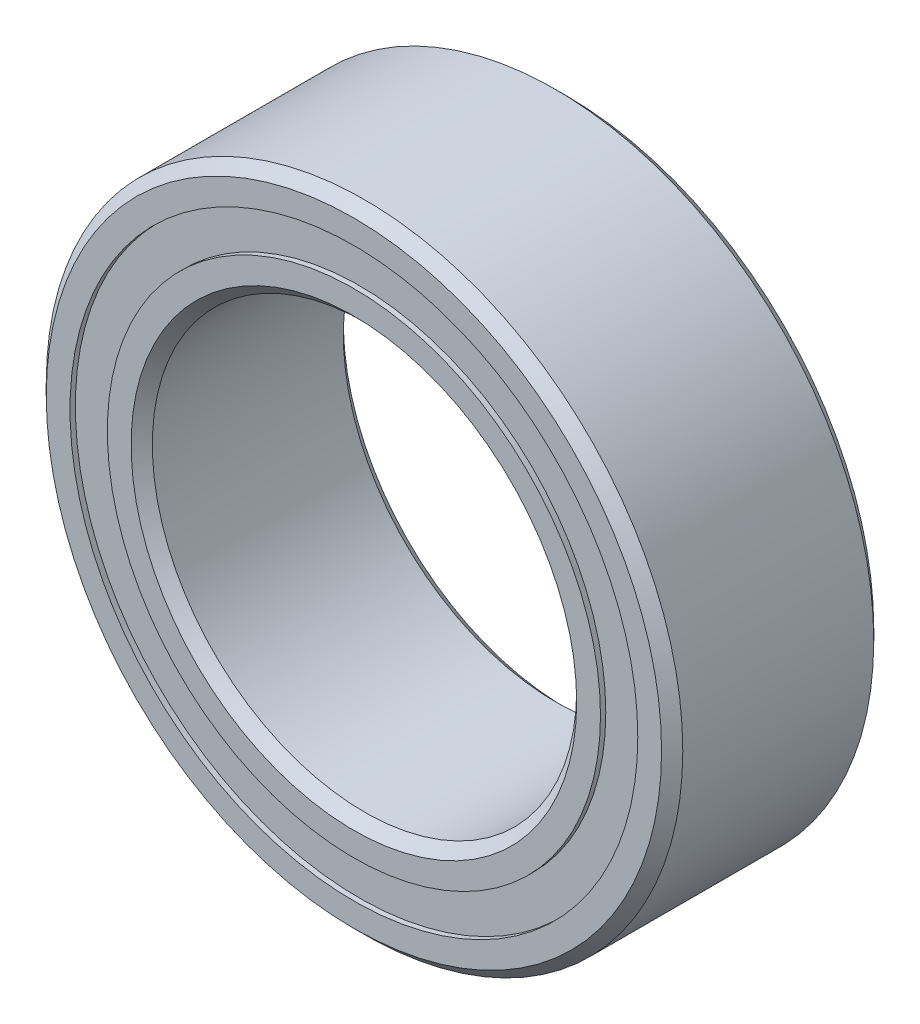
ISO-10303-21;
HEADER;
FILE_DESCRIPTION(('STEP AP214'),'2;1');
FILE_NAME('part.step','',(''),(''),'','','');
FILE_SCHEMA(('AUTOMOTIVE_DESIGN { 1 0 10303 214 1 1 1 1 }'));
ENDSEC;
DATA;
#1=APPLICATION_CONTEXT('core data for automotive mechanical design processes');
#2=APPLICATION_PROTOCOL_DEFINITION('international standard','automotive_design',2000,#1);
#3=PRODUCT_CONTEXT('',#1,'mechanical');
#4=PRODUCT('Part','Part','',(#3));
#5=PRODUCT_RELATED_PRODUCT_CATEGORY('part','',(#4));
#6=PRODUCT_DEFINITION_FORMATION('','',#4);
#7=PRODUCT_DEFINITION_CONTEXT('part definition',#1,'design');
#8=PRODUCT_DEFINITION('design','',#6,#7);
#9=PRODUCT_DEFINITION_SHAPE('','',#8);
#10=(LENGTH_UNIT() NAMED_UNIT(*) SI_UNIT(.MILLI.,.METRE.));
#11=(NAMED_UNIT(*) PLANE_ANGLE_UNIT() SI_UNIT($,.RADIAN.));
#12=(NAMED_UNIT(*) SI_UNIT($,.STERADIAN.) SOLID_ANGLE_UNIT());
#13=UNCERTAINTY_MEASURE_WITH_UNIT(LENGTH_MEASURE(1.E-05),#10,'distance_accuracy_value','');
#14=(GEOMETRIC_REPRESENTATION_CONTEXT(3) GLOBAL_UNCERTAINTY_ASSIGNED_CONTEXT((#13)) GLOBAL_UNIT_ASSIGNED_CONTEXT((#10,
#11,#12)) REPRESENTATION_CONTEXT('',''));
#15=CARTESIAN_POINT('',(0.,0.,0.));
#16=DIRECTION('',(0.,0.,1.));
#17=DIRECTION('',(1.,0.,0.));
#18=AXIS2_PLACEMENT_3D('',#15,#16,#17);
#19=CARTESIAN_POINT('',(-3.43703832126951,-1.98437499999997,0.));
#20=DIRECTION('',(-0.866025403784443,-0.499999999999992,0.));
#21=DIRECTION('',(0.,0.,-1.));
#22=AXIS2_PLACEMENT_3D('',#19,#20,#21);
#23=SPHERICAL_SURFACE('',#22,0.758760243513404);
#24=CARTESIAN_POINT('',(-4.09414396753379,-2.36375512175666,0.));
#25=VERTEX_POINT('',#24);
#26=VERTEX_LOOP('',#25);
#27=FACE_BOUND('',#26,.T.);
#28=CARTESIAN_POINT('',(-2.77993267500523,-1.60499487824327,0.));
#29=VERTEX_POINT('',#28);
#30=VERTEX_LOOP('',#29);
#31=FACE_BOUND('',#30,.T.);
#32=ADVANCED_FACE('P0_F15',(#27,#31),#23,.T.);
#33=CLOSED_SHELL('',(#32));
#34=MANIFOLD_SOLID_BREP('P0_B1',#33);
#35=CARTESIAN_POINT('',(-3.96875,0.,0.));
#36=DIRECTION('',(-1.,0.,0.));
#37=DIRECTION('',(0.,0.,-1.));
#38=AXIS2_PLACEMENT_3D('',#35,#36,#37);
#39=SPHERICAL_SURFACE('',#38,0.758760243513404);
#40=CARTESIAN_POINT('',(-4.7275102435134,0.,0.));
#41=VERTEX_POINT('',#40);
#42=VERTEX_LOOP('',#41);
#43=FACE_BOUND('',#42,.T.);
#44=CARTESIAN_POINT('',(-3.2099897564866,0.,0.));
#45=VERTEX_POINT('',#44);
#46=VERTEX_LOOP('',#45);
#47=FACE_BOUND('',#46,.T.);
#48=ADVANCED_FACE('P1_F15',(#43,#47),#39,.T.);
#49=CLOSED_SHELL('',(#48));
#50=MANIFOLD_SOLID_BREP('P1_B1',#49);
#51=CARTESIAN_POINT('',(0.,3.96875,0.));
#52=DIRECTION('',(0.,1.,0.));
#53=DIRECTION('',(0.,0.,-1.));
#54=AXIS2_PLACEMENT_3D('',#51,#52,#53);
#55=SPHERICAL_SURFACE('',#54,0.758760243513404);
#56=CARTESIAN_POINT('',(0.,3.2099897564866,0.));
#57=VERTEX_POINT('',#56);
#58=VERTEX_LOOP('',#57);
#59=FACE_BOUND('',#58,.T.);
#60=CARTESIAN_POINT('',(0.,4.7275102435134,0.));
#61=VERTEX_POINT('',#60);
#62=VERTEX_LOOP('',#61);
#63=FACE_BOUND('',#62,.T.);
#64=ADVANCED_FACE('P2_F15',(#59,#63),#55,.T.);
#65=CLOSED_SHELL('',(#64));
#66=MANIFOLD_SOLID_BREP('P2_B1',#65);
#67=CARTESIAN_POINT('',(3.43703832126948,-1.98437500000002,0.));
#68=DIRECTION('',(0.866025403784437,-0.500000000000004,0.));
#69=DIRECTION('',(0.,0.,-1.));
#70=AXIS2_PLACEMENT_3D('',#67,#68,#69);
#71=SPHERICAL_SURFACE('',#70,0.758760243513404);
#72=CARTESIAN_POINT('',(4.09414396753376,-2.36375512175672,0.));
#73=VERTEX_POINT('',#72);
#74=VERTEX_LOOP('',#73);
#75=FACE_BOUND('',#74,.T.);
#76=CARTESIAN_POINT('',(2.77993267500521,-1.60499487824331,0.));
#77=VERTEX_POINT('',#76);
#78=VERTEX_LOOP('',#77);
#79=FACE_BOUND('',#78,.T.);
#80=ADVANCED_FACE('P3_F15',(#75,#79),#71,.T.);
#81=CLOSED_SHELL('',(#80));
#82=MANIFOLD_SOLID_BREP('P3_B1',#81);
#83=CARTESIAN_POINT('',(-1.98437500000003,-3.43703832126947,0.));
#84=DIRECTION('',(-0.500000000000007,-0.866025403784435,0.));
#85=DIRECTION('',(0.,0.,-1.));
#86=AXIS2_PLACEMENT_3D('',#83,#84,#85);
#87=SPHERICAL_SURFACE('',#86,0.758760243513404);
#88=CARTESIAN_POINT('',(-2.36375512175674,-4.09414396753375,0.));
#89=VERTEX_POINT('',#88);
#90=VERTEX_LOOP('',#89);
#91=FACE_BOUND('',#90,.T.);
#92=CARTESIAN_POINT('',(-1.60499487824332,-2.7799326750052,0.));
#93=VERTEX_POINT('',#92);
#94=VERTEX_LOOP('',#93);
#95=FACE_BOUND('',#94,.T.);
#96=ADVANCED_FACE('P4_F15',(#91,#95),#87,.T.);
#97=CLOSED_SHELL('',(#96));
#98=MANIFOLD_SOLID_BREP('P4_B1',#97);
#99=CARTESIAN_POINT('',(3.96875,0.,0.));
#100=DIRECTION('',(1.,0.,0.));
#101=DIRECTION('',(0.,0.,-1.));
#102=AXIS2_PLACEMENT_3D('',#99,#100,#101);
#103=SPHERICAL_SURFACE('',#102,0.758760243513404);
#104=CARTESIAN_POINT('',(3.2099897564866,0.,0.));
#105=VERTEX_POINT('',#104);
#106=VERTEX_LOOP('',#105);
#107=FACE_BOUND('',#106,.T.);
#108=CARTESIAN_POINT('',(4.7275102435134,0.,0.));
#109=VERTEX_POINT('',#108);
#110=VERTEX_LOOP('',#109);
#111=FACE_BOUND('',#110,.T.);
#112=ADVANCED_FACE('P5_F15',(#107,#111),#103,.T.);
#113=CLOSED_SHELL('',(#112));
#114=MANIFOLD_SOLID_BREP('P5_B1',#113);
#115=CARTESIAN_POINT('',(0.,4.24787087912088,0.758760243513404));
#116=DIRECTION('',(0.,0.,1.));
#117=DIRECTION('',(1.,0.,0.));
#118=AXIS2_PLACEMENT_3D('',#115,#116,#117);
#119=PLANE('',#118);
#120=CARTESIAN_POINT('',(0.,0.,0.758760243513404));
#121=DIRECTION('',(0.,0.,1.));
#122=DIRECTION('',(1.,0.,0.));
#123=AXIS2_PLACEMENT_3D('',#120,#121,#122);
#124=CIRCLE('',#123,3.68962912087912);
#125=CARTESIAN_POINT('',(3.68962912087912,0.,0.758760243513404));
#126=VERTEX_POINT('',#125);
#127=EDGE_CURVE('P6_E17',#126,#126,#124,.T.);
#128=ORIENTED_EDGE('',*,*,#127,.T.);
#129=EDGE_LOOP('',(#128));
#130=FACE_BOUND('',#129,.T.);
#131=CARTESIAN_POINT('',(0.,0.,0.758760243513404));
#132=DIRECTION('',(0.,0.,1.));
#133=DIRECTION('',(1.,0.,0.));
#134=AXIS2_PLACEMENT_3D('',#131,#132,#133);
#135=CIRCLE('',#134,4.24787087912088);
#136=CARTESIAN_POINT('',(4.24787087912088,0.,0.758760243513404));
#137=VERTEX_POINT('',#136);
#138=EDGE_CURVE('P6_E26',#137,#137,#135,.T.);
#139=ORIENTED_EDGE('',*,*,#138,.F.);
#140=EDGE_LOOP('',(#139));
#141=FACE_BOUND('',#140,.T.);
#142=ADVANCED_FACE('P6_F14',(#130,#141),#119,.F.);
#143=CARTESIAN_POINT('',(0.,0.,1.5875));
#144=DIRECTION('',(0.,0.,1.));
#145=DIRECTION('',(1.,0.,0.));
#146=AXIS2_PLACEMENT_3D('',#143,#144,#145);
#147=CYLINDRICAL_SURFACE('',#146,3.68962912087912);
#148=ORIENTED_EDGE('',*,*,#127,.F.);
#149=EDGE_LOOP('',(#148));
#150=FACE_BOUND('',#149,.T.);
#151=CARTESIAN_POINT('',(0.,0.,1.508125));
#152=DIRECTION('',(0.,0.,1.));
#153=DIRECTION('',(1.,0.,0.));
#154=AXIS2_PLACEMENT_3D('',#151,#152,#153);
#155=CIRCLE('',#154,3.68962912087912);
#156=CARTESIAN_POINT('',(3.68962912087912,0.,1.508125));
#157=VERTEX_POINT('',#156);
#158=EDGE_CURVE('P6_E21',#157,#157,#155,.T.);
#159=ORIENTED_EDGE('',*,*,#158,.T.);
#160=EDGE_LOOP('',(#159));
#161=FACE_BOUND('',#160,.T.);
#162=ADVANCED_FACE('P6_F36',(#150,#161),#147,.F.);
#163=CARTESIAN_POINT('',(0.,0.,1.5875));
#164=DIRECTION('',(0.,0.,1.));
#165=DIRECTION('',(1.,0.,0.));
#166=AXIS2_PLACEMENT_3D('',#163,#164,#165);
#167=CYLINDRICAL_SURFACE('',#166,4.24787087912088);
#168=CARTESIAN_POINT('',(0.,0.,1.508125));
#169=DIRECTION('',(0.,0.,1.));
#170=DIRECTION('',(1.,0.,0.));
#171=AXIS2_PLACEMENT_3D('',#168,#169,#170);
#172=CIRCLE('',#171,4.24787087912088);
#173=CARTESIAN_POINT('',(4.24787087912088,0.,1.508125));
#174=VERTEX_POINT('',#173);
#175=EDGE_CURVE('P6_E10',#174,#174,#172,.F.);
#176=ORIENTED_EDGE('',*,*,#175,.T.);
#177=EDGE_LOOP('',(#176));
#178=FACE_BOUND('',#177,.T.);
#179=ORIENTED_EDGE('',*,*,#138,.T.);
#180=EDGE_LOOP('',(#179));
#181=FACE_BOUND('',#180,.T.);
#182=ADVANCED_FACE('P6_F39',(#178,#181),#167,.T.);
#183=CARTESIAN_POINT('',(0.,4.24787087912088,1.508125));
#184=DIRECTION('',(0.,0.,-1.));
#185=DIRECTION('',(-1.,0.,0.));
#186=AXIS2_PLACEMENT_3D('',#183,#184,#185);
#187=PLANE('',#186);
#188=ORIENTED_EDGE('',*,*,#175,.F.);
#189=EDGE_LOOP('',(#188));
#190=FACE_BOUND('',#189,.T.);
#191=ORIENTED_EDGE('',*,*,#158,.F.);
#192=EDGE_LOOP('',(#191));
#193=FACE_BOUND('',#192,.T.);
#194=ADVANCED_FACE('P6_F42',(#190,#193),#187,.F.);
#195=CLOSED_SHELL('',(#142,#162,#182,#194));
#196=MANIFOLD_SOLID_BREP('P6_B1',#195);
#197=CARTESIAN_POINT('',(1.984375,3.43703832126949,0.));
#198=DIRECTION('',(0.500000000000001,0.866025403784438,0.));
#199=DIRECTION('',(0.,0.,-1.));
#200=AXIS2_PLACEMENT_3D('',#197,#198,#199);
#201=SPHERICAL_SURFACE('',#200,0.758760243513404);
#202=CARTESIAN_POINT('',(2.36375512175671,4.09414396753376,0.));
#203=VERTEX_POINT('',#202);
#204=VERTEX_LOOP('',#203);
#205=FACE_BOUND('',#204,.T.);
#206=CARTESIAN_POINT('',(1.6049948782433,2.77993267500521,0.));
#207=VERTEX_POINT('',#206);
#208=VERTEX_LOOP('',#207);
#209=FACE_BOUND('',#208,.T.);
#210=ADVANCED_FACE('P7_F15',(#205,#209),#201,.T.);
#211=CLOSED_SHELL('',(#210));
#212=MANIFOLD_SOLID_BREP('P7_B1',#211);
#213=CARTESIAN_POINT('',(0.,0.,0.));
#214=DIRECTION('',(0.,0.,1.));
#215=DIRECTION('',(1.,0.,0.));
#216=AXIS2_PLACEMENT_3D('',#213,#214,#215);
#217=TOROIDAL_SURFACE('',#216,3.96875,0.758760243513404);
#218=CARTESIAN_POINT('',(0.,0.,-0.705555555555556));
#219=DIRECTION('',(0.,0.,1.));
#220=DIRECTION('',(1.,0.,0.));
#221=AXIS2_PLACEMENT_3D('',#218,#219,#220);
#222=CIRCLE('',#221,4.24787087912088);
#223=CARTESIAN_POINT('',(4.24787087912088,0.,-0.705555555555556));
#224=VERTEX_POINT('',#223);
#225=EDGE_CURVE('P8_E32',#224,#224,#222,.F.);
#226=ORIENTED_EDGE('',*,*,#225,.T.);
#227=EDGE_LOOP('',(#226));
#228=FACE_BOUND('',#227,.T.);
#229=CARTESIAN_POINT('',(0.,0.,0.705555555555555));
#230=DIRECTION('',(0.,0.,1.));
#231=DIRECTION('',(1.,0.,0.));
#232=AXIS2_PLACEMENT_3D('',#229,#230,#231);
#233=CIRCLE('',#232,4.24787087912088);
#234=CARTESIAN_POINT('',(4.24787087912088,0.,0.705555555555555));
#235=VERTEX_POINT('',#234);
#236=EDGE_CURVE('P8_E30',#235,#235,#233,.T.);
#237=ORIENTED_EDGE('',*,*,#236,.T.);
#238=EDGE_LOOP('',(#237));
#239=FACE_BOUND('',#238,.T.);
#240=ADVANCED_FACE('P8_F14',(#228,#239),#217,.F.);
#241=CARTESIAN_POINT('',(0.,0.,1.5875));
#242=DIRECTION('',(0.,0.,1.));
#243=DIRECTION('',(1.,0.,0.));
#244=AXIS2_PLACEMENT_3D('',#241,#242,#243);
#245=CYLINDRICAL_SURFACE('',#244,4.24787087912088);
#246=CARTESIAN_POINT('',(0.,0.,-1.5875));
#247=DIRECTION('',(0.,0.,1.));
#248=DIRECTION('',(1.,0.,0.));
#249=AXIS2_PLACEMENT_3D('',#246,#247,#248);
#250=CIRCLE('',#249,4.24787087912088);
#251=CARTESIAN_POINT('',(4.24787087912088,0.,-1.5875));
#252=VERTEX_POINT('',#251);
#253=EDGE_CURVE('P8_E18',#252,#252,#250,.F.);
#254=ORIENTED_EDGE('',*,*,#253,.T.);
#255=EDGE_LOOP('',(#254));
#256=FACE_BOUND('',#255,.T.);
#257=ORIENTED_EDGE('',*,*,#225,.F.);
#258=EDGE_LOOP('',(#257));
#259=FACE_BOUND('',#258,.T.);
#260=ADVANCED_FACE('P8_F48',(#256,#259),#245,.F.);
#261=CARTESIAN_POINT('',(0.,0.,1.5875));
#262=DIRECTION('',(0.,0.,1.));
#263=DIRECTION('',(1.,0.,0.));
#264=AXIS2_PLACEMENT_3D('',#261,#262,#263);
#265=CYLINDRICAL_SURFACE('',#264,4.24787087912088);
#266=ORIENTED_EDGE('',*,*,#236,.F.);
#267=EDGE_LOOP('',(#266));
#268=FACE_BOUND('',#267,.T.);
#269=CARTESIAN_POINT('',(0.,0.,1.5875));
#270=DIRECTION('',(0.,0.,1.));
#271=DIRECTION('',(1.,0.,0.));
#272=AXIS2_PLACEMENT_3D('',#269,#270,#271);
#273=CIRCLE('',#272,4.24787087912088);
#274=CARTESIAN_POINT('',(4.24787087912088,0.,1.5875));
#275=VERTEX_POINT('',#274);
#276=EDGE_CURVE('P8_E41',#275,#275,#273,.T.);
#277=ORIENTED_EDGE('',*,*,#276,.T.);
#278=EDGE_LOOP('',(#277));
#279=FACE_BOUND('',#278,.T.);
#280=ADVANCED_FACE('P8_F55',(#268,#279),#265,.F.);
#281=CARTESIAN_POINT('',(0.,4.60375,-1.5875));
#282=DIRECTION('',(0.,0.,1.));
#283=DIRECTION('',(1.,0.,0.));
#284=AXIS2_PLACEMENT_3D('',#281,#282,#283);
#285=PLANE('',#284);
#286=ORIENTED_EDGE('',*,*,#253,.F.);
#287=EDGE_LOOP('',(#286));
#288=FACE_BOUND('',#287,.T.);
#289=CARTESIAN_POINT('',(0.,0.,-1.58750000008467));
#290=DIRECTION('',(0.,0.,1.));
#291=DIRECTION('',(1.,0.,0.));
#292=AXIS2_PLACEMENT_3D('',#289,#290,#291);
#293=CIRCLE('',#292,4.60375000000113);
#294=CARTESIAN_POINT('',(4.60375000000113,0.,-1.58750000008467));
#295=VERTEX_POINT('',#294);
#296=EDGE_CURVE('P8_E39',#295,#295,#293,.T.);
#297=ORIENTED_EDGE('',*,*,#296,.F.);
#298=EDGE_LOOP('',(#297));
#299=FACE_BOUND('',#298,.T.);
#300=ADVANCED_FACE('P8_F51',(#288,#299),#285,.F.);
#301=CARTESIAN_POINT('',(0.,4.60375,1.5875));
#302=DIRECTION('',(0.,0.,-1.));
#303=DIRECTION('',(-1.,0.,0.));
#304=AXIS2_PLACEMENT_3D('',#301,#302,#303);
#305=PLANE('',#304);
#306=CARTESIAN_POINT('',(0.,0.,1.58750000008467));
#307=DIRECTION('',(0.,0.,-1.));
#308=DIRECTION('',(-1.,0.,0.));
#309=AXIS2_PLACEMENT_3D('',#306,#307,#308);
#310=CIRCLE('',#309,4.60375000000113);
#311=CARTESIAN_POINT('',(-4.60375000000113,0.,1.58750000008467));
#312=VERTEX_POINT('',#311);
#313=EDGE_CURVE('P8_E27',#312,#312,#310,.T.);
#314=ORIENTED_EDGE('',*,*,#313,.F.);
#315=EDGE_LOOP('',(#314));
#316=FACE_BOUND('',#315,.T.);
#317=ORIENTED_EDGE('',*,*,#276,.F.);
#318=EDGE_LOOP('',(#317));
#319=FACE_BOUND('',#318,.T.);
#320=ADVANCED_FACE('P8_F54',(#316,#319),#305,.F.);
#321=CARTESIAN_POINT('',(0.,0.,-1.42875000000231));
#322=DIRECTION('',(0.,0.,1.));
#323=DIRECTION('',(1.,0.,0.));
#324=AXIS2_PLACEMENT_3D('',#321,#322,#323);
#325=CONICAL_SURFACE('',#324,4.76250000002665,0.785398163218414);
#326=CARTESIAN_POINT('',(0.,0.,-1.42875));
#327=DIRECTION('',(0.,0.,1.));
#328=DIRECTION('',(1.,0.,0.));
#329=AXIS2_PLACEMENT_3D('',#326,#327,#328);
#330=CIRCLE('',#329,4.7625);
#331=CARTESIAN_POINT('',(4.7625,0.,-1.42875));
#332=VERTEX_POINT('',#331);
#333=EDGE_CURVE('P8_E22',#332,#332,#330,.T.);
#334=ORIENTED_EDGE('',*,*,#333,.F.);
#335=EDGE_LOOP('',(#334));
#336=FACE_BOUND('',#335,.T.);
#337=ORIENTED_EDGE('',*,*,#296,.T.);
#338=EDGE_LOOP('',(#337));
#339=FACE_BOUND('',#338,.T.);
#340=ADVANCED_FACE('P8_F59',(#336,#339),#325,.T.);
#341=CARTESIAN_POINT('',(0.,0.,1.42875000005915));
#342=DIRECTION('',(0.,0.,-1.));
#343=DIRECTION('',(-1.,0.,0.));
#344=AXIS2_PLACEMENT_3D('',#341,#342,#343);
#345=CONICAL_SURFACE('',#344,4.7624999999698,0.785398163218414);
#346=CARTESIAN_POINT('',(0.,0.,1.42875));
#347=DIRECTION('',(0.,0.,1.));
#348=DIRECTION('',(1.,0.,0.));
#349=AXIS2_PLACEMENT_3D('',#346,#347,#348);
#350=CIRCLE('',#349,4.7625);
#351=CARTESIAN_POINT('',(4.7625,0.,1.42875));
#352=VERTEX_POINT('',#351);
#353=EDGE_CURVE('P8_E10',#352,#352,#350,.F.);
#354=ORIENTED_EDGE('',*,*,#353,.F.);
#355=EDGE_LOOP('',(#354));
#356=FACE_BOUND('',#355,.T.);
#357=ORIENTED_EDGE('',*,*,#313,.T.);
#358=EDGE_LOOP('',(#357));
#359=FACE_BOUND('',#358,.T.);
#360=ADVANCED_FACE('P8_F61',(#356,#359),#345,.T.);
#361=CARTESIAN_POINT('',(0.,0.,1.5875));
#362=DIRECTION('',(0.,0.,1.));
#363=DIRECTION('',(1.,0.,0.));
#364=AXIS2_PLACEMENT_3D('',#361,#362,#363);
#365=CYLINDRICAL_SURFACE('',#364,4.7625);
#366=ORIENTED_EDGE('',*,*,#353,.T.);
#367=EDGE_LOOP('',(#366));
#368=FACE_BOUND('',#367,.T.);
#369=ORIENTED_EDGE('',*,*,#333,.T.);
#370=EDGE_LOOP('',(#369));
#371=FACE_BOUND('',#370,.T.);
#372=ADVANCED_FACE('P8_F69',(#368,#371),#365,.T.);
#373=CLOSED_SHELL('',(#240,#260,#280,#300,#320,#340,#360,#372));
#374=MANIFOLD_SOLID_BREP('P8_B1',#373);
#375=CARTESIAN_POINT('',(3.4370383212695,1.98437499999999,0.));
#376=DIRECTION('',(0.86602540378444,0.499999999999998,0.));
#377=DIRECTION('',(0.,0.,-1.));
#378=AXIS2_PLACEMENT_3D('',#375,#376,#377);
#379=SPHERICAL_SURFACE('',#378,0.758760243513404);
#380=CARTESIAN_POINT('',(4.09414396753377,2.36375512175669,0.));
#381=VERTEX_POINT('',#380);
#382=VERTEX_LOOP('',#381);
#383=FACE_BOUND('',#382,.T.);
#384=CARTESIAN_POINT('',(2.77993267500522,1.60499487824329,0.));
#385=VERTEX_POINT('',#384);
#386=VERTEX_LOOP('',#385);
#387=FACE_BOUND('',#386,.T.);
#388=ADVANCED_FACE('P9_F15',(#383,#387),#379,.T.);
#389=CLOSED_SHELL('',(#388));
#390=MANIFOLD_SOLID_BREP('P9_B1',#389);
#391=CARTESIAN_POINT('',(0.,-3.96875,0.));
#392=DIRECTION('',(0.,-1.,0.));
#393=DIRECTION('',(0.,0.,-1.));
#394=AXIS2_PLACEMENT_3D('',#391,#392,#393);
#395=SPHERICAL_SURFACE('',#394,0.758760243513404);
#396=CARTESIAN_POINT('',(0.,-3.2099897564866,0.));
#397=VERTEX_POINT('',#396);
#398=VERTEX_LOOP('',#397);
#399=FACE_BOUND('',#398,.T.);
#400=CARTESIAN_POINT('',(0.,-4.7275102435134,0.));
#401=VERTEX_POINT('',#400);
#402=VERTEX_LOOP('',#401);
#403=FACE_BOUND('',#402,.T.);
#404=ADVANCED_FACE('P10_F15',(#399,#403),#395,.T.);
#405=CLOSED_SHELL('',(#404));
#406=MANIFOLD_SOLID_BREP('P10_B1',#405);
#407=CARTESIAN_POINT('',(0.,4.24787087912088,-1.508125));
#408=DIRECTION('',(0.,0.,1.));
#409=DIRECTION('',(1.,0.,0.));
#410=AXIS2_PLACEMENT_3D('',#407,#408,#409);
#411=PLANE('',#410);
#412=CARTESIAN_POINT('',(0.,0.,-1.508125));
#413=DIRECTION('',(0.,0.,1.));
#414=DIRECTION('',(1.,0.,0.));
#415=AXIS2_PLACEMENT_3D('',#412,#413,#414);
#416=CIRCLE('',#415,3.68962912087912);
#417=CARTESIAN_POINT('',(3.68962912087912,0.,-1.508125));
#418=VERTEX_POINT('',#417);
#419=EDGE_CURVE('P11_E17',#418,#418,#416,.T.);
#420=ORIENTED_EDGE('',*,*,#419,.T.);
#421=EDGE_LOOP('',(#420));
#422=FACE_BOUND('',#421,.T.);
#423=CARTESIAN_POINT('',(0.,0.,-1.508125));
#424=DIRECTION('',(0.,0.,1.));
#425=DIRECTION('',(1.,0.,0.));
#426=AXIS2_PLACEMENT_3D('',#423,#424,#425);
#427=CIRCLE('',#426,4.24787087912088);
#428=CARTESIAN_POINT('',(4.24787087912088,0.,-1.508125));
#429=VERTEX_POINT('',#428);
#430=EDGE_CURVE('P11_E26',#429,#429,#427,.T.);
#431=ORIENTED_EDGE('',*,*,#430,.F.);
#432=EDGE_LOOP('',(#431));
#433=FACE_BOUND('',#432,.T.);
#434=ADVANCED_FACE('P11_F14',(#422,#433),#411,.F.);
#435=CARTESIAN_POINT('',(0.,0.,1.5875));
#436=DIRECTION('',(0.,0.,1.));
#437=DIRECTION('',(1.,0.,0.));
#438=AXIS2_PLACEMENT_3D('',#435,#436,#437);
#439=CYLINDRICAL_SURFACE('',#438,3.68962912087912);
#440=ORIENTED_EDGE('',*,*,#419,.F.);
#441=EDGE_LOOP('',(#440));
#442=FACE_BOUND('',#441,.T.);
#443=CARTESIAN_POINT('',(0.,0.,-0.758760243513405));
#444=DIRECTION('',(0.,0.,1.));
#445=DIRECTION('',(1.,0.,0.));
#446=AXIS2_PLACEMENT_3D('',#443,#444,#445);
#447=CIRCLE('',#446,3.68962912087912);
#448=CARTESIAN_POINT('',(3.68962912087912,0.,-0.758760243513405));
#449=VERTEX_POINT('',#448);
#450=EDGE_CURVE('P11_E21',#449,#449,#447,.T.);
#451=ORIENTED_EDGE('',*,*,#450,.T.);
#452=EDGE_LOOP('',(#451));
#453=FACE_BOUND('',#452,.T.);
#454=ADVANCED_FACE('P11_F36',(#442,#453),#439,.F.);
#455=CARTESIAN_POINT('',(0.,0.,1.5875));
#456=DIRECTION('',(0.,0.,1.));
#457=DIRECTION('',(1.,0.,0.));
#458=AXIS2_PLACEMENT_3D('',#455,#456,#457);
#459=CYLINDRICAL_SURFACE('',#458,4.24787087912088);
#460=CARTESIAN_POINT('',(0.,0.,-0.758760243513404));
#461=DIRECTION('',(0.,0.,1.));
#462=DIRECTION('',(1.,0.,0.));
#463=AXIS2_PLACEMENT_3D('',#460,#461,#462);
#464=CIRCLE('',#463,4.24787087912088);
#465=CARTESIAN_POINT('',(4.24787087912088,0.,-0.758760243513404));
#466=VERTEX_POINT('',#465);
#467=EDGE_CURVE('P11_E10',#466,#466,#464,.F.);
#468=ORIENTED_EDGE('',*,*,#467,.T.);
#469=EDGE_LOOP('',(#468));
#470=FACE_BOUND('',#469,.T.);
#471=ORIENTED_EDGE('',*,*,#430,.T.);
#472=EDGE_LOOP('',(#471));
#473=FACE_BOUND('',#472,.T.);
#474=ADVANCED_FACE('P11_F39',(#470,#473),#459,.T.);
#475=CARTESIAN_POINT('',(0.,4.24787087912088,-0.758760243513404));
#476=DIRECTION('',(0.,0.,-1.));
#477=DIRECTION('',(-1.,0.,0.));
#478=AXIS2_PLACEMENT_3D('',#475,#476,#477);
#479=PLANE('',#478);
#480=ORIENTED_EDGE('',*,*,#467,.F.);
#481=EDGE_LOOP('',(#480));
#482=FACE_BOUND('',#481,.T.);
#483=ORIENTED_EDGE('',*,*,#450,.F.);
#484=EDGE_LOOP('',(#483));
#485=FACE_BOUND('',#484,.T.);
#486=ADVANCED_FACE('P11_F42',(#482,#485),#479,.F.);
#487=CLOSED_SHELL('',(#434,#454,#474,#486));
#488=MANIFOLD_SOLID_BREP('P11_B1',#487);
#489=CARTESIAN_POINT('',(-3.43703832126947,1.98437500000004,0.));
#490=DIRECTION('',(-0.866025403784433,0.50000000000001,0.));
#491=DIRECTION('',(0.,0.,-1.));
#492=AXIS2_PLACEMENT_3D('',#489,#490,#491);
#493=SPHERICAL_SURFACE('',#492,0.758760243513404);
#494=CARTESIAN_POINT('',(-4.09414396753374,2.36375512175675,0.));
#495=VERTEX_POINT('',#494);
#496=VERTEX_LOOP('',#495);
#497=FACE_BOUND('',#496,.T.);
#498=CARTESIAN_POINT('',(-2.7799326750052,1.60499487824333,0.));
#499=VERTEX_POINT('',#498);
#500=VERTEX_LOOP('',#499);
#501=FACE_BOUND('',#500,.T.);
#502=ADVANCED_FACE('P12_F15',(#497,#501),#493,.T.);
#503=CLOSED_SHELL('',(#502));
#504=MANIFOLD_SOLID_BREP('P12_B1',#503);
#505=CARTESIAN_POINT('',(0.,0.,0.));
#506=DIRECTION('',(0.,0.,1.));
#507=DIRECTION('',(1.,0.,0.));
#508=AXIS2_PLACEMENT_3D('',#505,#506,#507);
#509=TOROIDAL_SURFACE('',#508,3.96875,0.758760243513403);
#510=CARTESIAN_POINT('',(0.,0.,0.705555555555556));
#511=DIRECTION('',(0.,0.,1.));
#512=DIRECTION('',(1.,0.,0.));
#513=AXIS2_PLACEMENT_3D('',#510,#511,#512);
#514=CIRCLE('',#513,3.68962912087912);
#515=CARTESIAN_POINT('',(3.68962912087912,0.,0.705555555555556));
#516=VERTEX_POINT('',#515);
#517=EDGE_CURVE('P13_E32',#516,#516,#514,.T.);
#518=ORIENTED_EDGE('',*,*,#517,.F.);
#519=EDGE_LOOP('',(#518));
#520=FACE_BOUND('',#519,.T.);
#521=CARTESIAN_POINT('',(0.,0.,-0.705555555555556));
#522=DIRECTION('',(0.,0.,1.));
#523=DIRECTION('',(1.,0.,0.));
#524=AXIS2_PLACEMENT_3D('',#521,#522,#523);
#525=CIRCLE('',#524,3.68962912087912);
#526=CARTESIAN_POINT('',(3.68962912087912,0.,-0.705555555555556));
#527=VERTEX_POINT('',#526);
#528=EDGE_CURVE('P13_E30',#527,#527,#525,.F.);
#529=ORIENTED_EDGE('',*,*,#528,.F.);
#530=EDGE_LOOP('',(#529));
#531=FACE_BOUND('',#530,.T.);
#532=ADVANCED_FACE('P13_F14',(#520,#531),#509,.F.);
#533=CARTESIAN_POINT('',(0.,0.,1.5875));
#534=DIRECTION('',(0.,0.,1.));
#535=DIRECTION('',(1.,0.,0.));
#536=AXIS2_PLACEMENT_3D('',#533,#534,#535);
#537=CYLINDRICAL_SURFACE('',#536,3.68962912087912);
#538=CARTESIAN_POINT('',(0.,0.,1.5875));
#539=DIRECTION('',(0.,0.,1.));
#540=DIRECTION('',(1.,0.,0.));
#541=AXIS2_PLACEMENT_3D('',#538,#539,#540);
#542=CIRCLE('',#541,3.68962912087912);
#543=CARTESIAN_POINT('',(3.68962912087912,0.,1.5875));
#544=VERTEX_POINT('',#543);
#545=EDGE_CURVE('P13_E18',#544,#544,#542,.F.);
#546=ORIENTED_EDGE('',*,*,#545,.T.);
#547=EDGE_LOOP('',(#546));
#548=FACE_BOUND('',#547,.T.);
#549=ORIENTED_EDGE('',*,*,#517,.T.);
#550=EDGE_LOOP('',(#549));
#551=FACE_BOUND('',#550,.T.);
#552=ADVANCED_FACE('P13_F48',(#548,#551),#537,.T.);
#553=CARTESIAN_POINT('',(0.,0.,1.5875));
#554=DIRECTION('',(0.,0.,1.));
#555=DIRECTION('',(1.,0.,0.));
#556=AXIS2_PLACEMENT_3D('',#553,#554,#555);
#557=CYLINDRICAL_SURFACE('',#556,3.68962912087912);
#558=ORIENTED_EDGE('',*,*,#528,.T.);
#559=EDGE_LOOP('',(#558));
#560=FACE_BOUND('',#559,.T.);
#561=CARTESIAN_POINT('',(0.,0.,-1.5875));
#562=DIRECTION('',(0.,0.,1.));
#563=DIRECTION('',(1.,0.,0.));
#564=AXIS2_PLACEMENT_3D('',#561,#562,#563);
#565=CIRCLE('',#564,3.68962912087912);
#566=CARTESIAN_POINT('',(3.68962912087912,0.,-1.5875));
#567=VERTEX_POINT('',#566);
#568=EDGE_CURVE('P13_E41',#567,#567,#565,.T.);
#569=ORIENTED_EDGE('',*,*,#568,.T.);
#570=EDGE_LOOP('',(#569));
#571=FACE_BOUND('',#570,.T.);
#572=ADVANCED_FACE('P13_F55',(#560,#571),#557,.T.);
#573=CARTESIAN_POINT('',(0.,3.68962912087912,1.5875));
#574=DIRECTION('',(0.,0.,-1.));
#575=DIRECTION('',(-1.,0.,0.));
#576=AXIS2_PLACEMENT_3D('',#573,#574,#575);
#577=PLANE('',#576);
#578=ORIENTED_EDGE('',*,*,#545,.F.);
#579=EDGE_LOOP('',(#578));
#580=FACE_BOUND('',#579,.T.);
#581=CARTESIAN_POINT('',(0.,0.,1.58749999997099));
#582=DIRECTION('',(0.,0.,1.));
#583=DIRECTION('',(1.,0.,0.));
#584=AXIS2_PLACEMENT_3D('',#581,#582,#583);
#585=CIRCLE('',#584,3.33374999996749);
#586=CARTESIAN_POINT('',(3.33374999996749,0.,1.58749999997099));
#587=VERTEX_POINT('',#586);
#588=EDGE_CURVE('P13_E39',#587,#587,#585,.F.);
#589=ORIENTED_EDGE('',*,*,#588,.T.);
#590=EDGE_LOOP('',(#589));
#591=FACE_BOUND('',#590,.T.);
#592=ADVANCED_FACE('P13_F51',(#580,#591),#577,.F.);
#593=CARTESIAN_POINT('',(0.,3.33375,-1.5875));
#594=DIRECTION('',(0.,0.,1.));
#595=DIRECTION('',(1.,0.,0.));
#596=AXIS2_PLACEMENT_3D('',#593,#594,#595);
#597=PLANE('',#596);
#598=CARTESIAN_POINT('',(0.,0.,-1.58749999997099));
#599=DIRECTION('',(0.,0.,-1.));
#600=DIRECTION('',(0.,1.,0.));
#601=AXIS2_PLACEMENT_3D('',#598,#599,#600);
#602=CIRCLE('',#601,3.33375000002434);
#603=CARTESIAN_POINT('',(0.,3.33375000002434,-1.58749999997099));
#604=VERTEX_POINT('',#603);
#605=EDGE_CURVE('P13_E27',#604,#604,#602,.F.);
#606=ORIENTED_EDGE('',*,*,#605,.T.);
#607=EDGE_LOOP('',(#606));
#608=FACE_BOUND('',#607,.T.);
#609=ORIENTED_EDGE('',*,*,#568,.F.);
#610=EDGE_LOOP('',(#609));
#611=FACE_BOUND('',#610,.T.);
#612=ADVANCED_FACE('P13_F54',(#608,#611),#597,.F.);
#613=CARTESIAN_POINT('',(0.,0.,1.58749999991414));
#614=DIRECTION('',(0.,0.,1.));
#615=DIRECTION('',(1.,0.,0.));
#616=AXIS2_PLACEMENT_3D('',#613,#614,#615);
#617=CONICAL_SURFACE('',#616,3.33374999991065,0.785398163397448);
#618=ORIENTED_EDGE('',*,*,#588,.F.);
#619=EDGE_LOOP('',(#618));
#620=FACE_BOUND('',#619,.T.);
#621=CARTESIAN_POINT('',(0.,0.,1.42875));
#622=DIRECTION('',(0.,0.,1.));
#623=DIRECTION('',(1.,0.,0.));
#624=AXIS2_PLACEMENT_3D('',#621,#622,#623);
#625=CIRCLE('',#624,3.175);
#626=CARTESIAN_POINT('',(3.175,0.,1.42875));
#627=VERTEX_POINT('',#626);
#628=EDGE_CURVE('P13_E22',#627,#627,#625,.F.);
#629=ORIENTED_EDGE('',*,*,#628,.T.);
#630=EDGE_LOOP('',(#629));
#631=FACE_BOUND('',#630,.T.);
#632=ADVANCED_FACE('P13_F59',(#620,#631),#617,.F.);
#633=CARTESIAN_POINT('',(0.,0.,-1.58749999997099));
#634=DIRECTION('',(0.,0.,-1.));
#635=DIRECTION('',(0.,1.,0.));
#636=AXIS2_PLACEMENT_3D('',#633,#634,#635);
#637=CONICAL_SURFACE('',#636,3.33375000002434,0.785398163397448);
#638=CARTESIAN_POINT('',(0.,0.,-1.42875));
#639=DIRECTION('',(0.,0.,1.));
#640=DIRECTION('',(1.,0.,0.));
#641=AXIS2_PLACEMENT_3D('',#638,#639,#640);
#642=CIRCLE('',#641,3.175);
#643=CARTESIAN_POINT('',(3.175,0.,-1.42875));
#644=VERTEX_POINT('',#643);
#645=EDGE_CURVE('P13_E10',#644,#644,#642,.T.);
#646=ORIENTED_EDGE('',*,*,#645,.T.);
#647=EDGE_LOOP('',(#646));
#648=FACE_BOUND('',#647,.T.);
#649=ORIENTED_EDGE('',*,*,#605,.F.);
#650=EDGE_LOOP('',(#649));
#651=FACE_BOUND('',#650,.T.);
#652=ADVANCED_FACE('P13_F62',(#648,#651),#637,.F.);
#653=CARTESIAN_POINT('',(0.,0.,1.5875));
#654=DIRECTION('',(0.,0.,1.));
#655=DIRECTION('',(1.,0.,0.));
#656=AXIS2_PLACEMENT_3D('',#653,#654,#655);
#657=CYLINDRICAL_SURFACE('',#656,3.175);
#658=ORIENTED_EDGE('',*,*,#628,.F.);
#659=EDGE_LOOP('',(#658));
#660=FACE_BOUND('',#659,.T.);
#661=ORIENTED_EDGE('',*,*,#645,.F.);
#662=EDGE_LOOP('',(#661));
#663=FACE_BOUND('',#662,.T.);
#664=ADVANCED_FACE('P13_F66',(#660,#663),#657,.F.);
#665=CLOSED_SHELL('',(#532,#552,#572,#592,#612,#632,#652,#664));
#666=MANIFOLD_SOLID_BREP('P13_B1',#665);
#667=CARTESIAN_POINT('',(1.98437499999998,-3.4370383212695,0.));
#668=DIRECTION('',(0.499999999999995,-0.866025403784442,0.));
#669=DIRECTION('',(0.,0.,-1.));
#670=AXIS2_PLACEMENT_3D('',#667,#668,#669);
#671=SPHERICAL_SURFACE('',#670,0.758760243513404);
#672=CARTESIAN_POINT('',(1.60499487824328,-2.77993267500523,0.));
#673=VERTEX_POINT('',#672);
#674=VERTEX_LOOP('',#673);
#675=FACE_BOUND('',#674,.T.);
#676=CARTESIAN_POINT('',(2.36375512175668,-4.09414396753378,0.));
#677=VERTEX_POINT('',#676);
#678=VERTEX_LOOP('',#677);
#679=FACE_BOUND('',#678,.T.);
#680=ADVANCED_FACE('P14_F15',(#675,#679),#671,.T.);
#681=CLOSED_SHELL('',(#680));
#682=MANIFOLD_SOLID_BREP('P14_B1',#681);
#683=CARTESIAN_POINT('',(-1.98437499999996,3.43703832126952,0.));
#684=DIRECTION('',(-0.499999999999989,0.866025403784445,0.));
#685=DIRECTION('',(0.,0.,-1.));
#686=AXIS2_PLACEMENT_3D('',#683,#684,#685);
#687=SPHERICAL_SURFACE('',#686,0.758760243513404);
#688=CARTESIAN_POINT('',(-2.36375512175665,4.0941439675338,0.));
#689=VERTEX_POINT('',#688);
#690=VERTEX_LOOP('',#689);
#691=FACE_BOUND('',#690,.T.);
#692=CARTESIAN_POINT('',(-1.60499487824326,2.77993267500524,0.));
#693=VERTEX_POINT('',#692);
#694=VERTEX_LOOP('',#693);
#695=FACE_BOUND('',#694,.T.);
#696=ADVANCED_FACE('P15_F15',(#691,#695),#687,.T.);
#697=CLOSED_SHELL('',(#696));
#698=MANIFOLD_SOLID_BREP('P15_B1',#697);
#699=ADVANCED_BREP_SHAPE_REPRESENTATION('',(#18,#34,#50,#66,#82,#98,#114,#196,#212,#374,#390,
#406,#488,#504,#666,#682,#698),#14);
#700=SHAPE_DEFINITION_REPRESENTATION(#9,#699);
ENDSEC;
END-ISO-10303-21;
